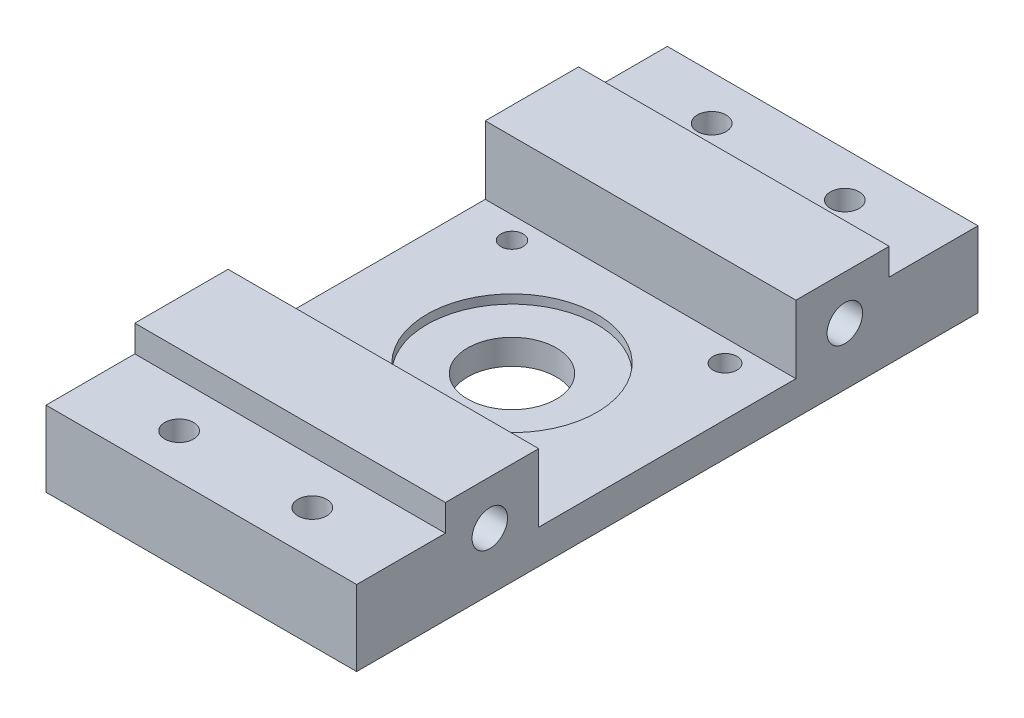
ISO-10303-21;
HEADER;
FILE_DESCRIPTION(('STEP AP214'),'2;1');
FILE_NAME('part.step','',(''),(''),'','','');
FILE_SCHEMA(('AUTOMOTIVE_DESIGN { 1 0 10303 214 1 1 1 1 }'));
ENDSEC;
DATA;
#1=APPLICATION_CONTEXT('core data for automotive mechanical design processes');
#2=APPLICATION_PROTOCOL_DEFINITION('international standard','automotive_design',2000,#1);
#3=PRODUCT_CONTEXT('',#1,'mechanical');
#4=PRODUCT('Part','Part','',(#3));
#5=PRODUCT_RELATED_PRODUCT_CATEGORY('part','',(#4));
#6=PRODUCT_DEFINITION_FORMATION('','',#4);
#7=PRODUCT_DEFINITION_CONTEXT('part definition',#1,'design');
#8=PRODUCT_DEFINITION('design','',#6,#7);
#9=PRODUCT_DEFINITION_SHAPE('','',#8);
#10=(LENGTH_UNIT() NAMED_UNIT(*) SI_UNIT(.MILLI.,.METRE.));
#11=(NAMED_UNIT(*) PLANE_ANGLE_UNIT() SI_UNIT($,.RADIAN.));
#12=(NAMED_UNIT(*) SI_UNIT($,.STERADIAN.) SOLID_ANGLE_UNIT());
#13=UNCERTAINTY_MEASURE_WITH_UNIT(LENGTH_MEASURE(1.E-05),#10,'distance_accuracy_value','');
#14=(GEOMETRIC_REPRESENTATION_CONTEXT(3) GLOBAL_UNCERTAINTY_ASSIGNED_CONTEXT((#13)) GLOBAL_UNIT_ASSIGNED_CONTEXT((#10,
#11,#12)) REPRESENTATION_CONTEXT('',''));
#15=CARTESIAN_POINT('',(0.,0.,0.));
#16=DIRECTION('',(0.,0.,1.));
#17=DIRECTION('',(1.,0.,0.));
#18=AXIS2_PLACEMENT_3D('',#15,#16,#17);
#19=CARTESIAN_POINT('',(70.,20.0000021468173,-50.));
#20=DIRECTION('',(0.,-1.,0.));
#21=DIRECTION('',(0.,0.,-1.));
#22=AXIS2_PLACEMENT_3D('',#19,#20,#21);
#23=PLANE('',#22);
#24=DIRECTION('',(0.,0.,1.));
#25=VECTOR('',#24,1.);
#26=CARTESIAN_POINT('',(70.,20.0000021468173,-50.));
#27=LINE('',#26,#25);
#28=CARTESIAN_POINT('',(70.,20.0000021468173,28.9755250101508));
#29=VERTEX_POINT('',#28);
#30=CARTESIAN_POINT('',(70.,20.0000021468172,50.));
#31=VERTEX_POINT('',#30);
#32=EDGE_CURVE('E223',#29,#31,#27,.T.);
#33=ORIENTED_EDGE('',*,*,#32,.F.);
#34=DIRECTION('',(1.,0.,0.));
#35=VECTOR('',#34,1.);
#36=CARTESIAN_POINT('',(70.001,20.0000021468173,28.9755250101508));
#37=LINE('',#36,#35);
#38=CARTESIAN_POINT('',(0.,20.0000021468173,28.9755250101508));
#39=VERTEX_POINT('',#38);
#40=EDGE_CURVE('E213',#39,#29,#37,.T.);
#41=ORIENTED_EDGE('',*,*,#40,.F.);
#42=DIRECTION('',(0.,0.,1.));
#43=VECTOR('',#42,1.);
#44=CARTESIAN_POINT('',(0.,20.0000021468173,-50.));
#45=LINE('',#44,#43);
#46=CARTESIAN_POINT('',(0.,20.0000021468172,50.));
#47=VERTEX_POINT('',#46);
#48=EDGE_CURVE('E151',#39,#47,#45,.T.);
#49=ORIENTED_EDGE('',*,*,#48,.T.);
#50=DIRECTION('',(-1.,0.,0.));
#51=VECTOR('',#50,1.);
#52=CARTESIAN_POINT('',(70.,20.0000021468172,50.));
#53=LINE('',#52,#51);
#54=EDGE_CURVE('E165',#31,#47,#53,.T.);
#55=ORIENTED_EDGE('',*,*,#54,.F.);
#56=EDGE_LOOP('',(#33,#41,#49,#55));
#57=FACE_BOUND('',#56,.T.);
#58=ADVANCED_FACE('F33',(#57),#23,.F.);
#59=CARTESIAN_POINT('',(70.,-2.99999785318272,-70.0054460886443));
#60=DIRECTION('',(0.,0.,1.));
#61=DIRECTION('',(1.,0.,0.));
#62=AXIS2_PLACEMENT_3D('',#59,#60,#61);
#63=PLANE('',#62);
#64=DIRECTION('',(0.,1.,0.));
#65=VECTOR('',#64,1.);
#66=CARTESIAN_POINT('',(0.,-2.99999785318272,-70.0054460886443));
#67=LINE('',#66,#65);
#68=CARTESIAN_POINT('',(0.,-2.99999785318272,-70.0054460886443));
#69=VERTEX_POINT('',#68);
#70=CARTESIAN_POINT('',(0.,14.0000021468173,-70.0054460886443));
#71=VERTEX_POINT('',#70);
#72=EDGE_CURVE('E143',#69,#71,#67,.T.);
#73=ORIENTED_EDGE('',*,*,#72,.T.);
#74=DIRECTION('',(-1.,0.,0.));
#75=VECTOR('',#74,1.);
#76=CARTESIAN_POINT('',(70.,14.0000021468173,-70.0054460886443));
#77=LINE('',#76,#75);
#78=CARTESIAN_POINT('',(70.,14.0000021468173,-70.0054460886443));
#79=VERTEX_POINT('',#78);
#80=EDGE_CURVE('E11',#79,#71,#77,.T.);
#81=ORIENTED_EDGE('',*,*,#80,.F.);
#82=DIRECTION('',(0.,1.,0.));
#83=VECTOR('',#82,1.);
#84=CARTESIAN_POINT('',(70.,-2.99999785318272,-70.0054460886443));
#85=LINE('',#84,#83);
#86=CARTESIAN_POINT('',(70.,-2.99999785318272,-70.0054460886443));
#87=VERTEX_POINT('',#86);
#88=EDGE_CURVE('E161',#87,#79,#85,.T.);
#89=ORIENTED_EDGE('',*,*,#88,.F.);
#90=DIRECTION('',(-1.,0.,0.));
#91=VECTOR('',#90,1.);
#92=CARTESIAN_POINT('',(70.,-2.99999785318272,-70.0054460886443));
#93=LINE('',#92,#91);
#94=EDGE_CURVE('E139',#87,#69,#93,.T.);
#95=ORIENTED_EDGE('',*,*,#94,.T.);
#96=EDGE_LOOP('',(#73,#81,#89,#95));
#97=FACE_BOUND('',#96,.T.);
#98=ADVANCED_FACE('F35',(#97),#63,.F.);
#99=CARTESIAN_POINT('',(70.,14.0000021468173,-70.0054460886443));
#100=DIRECTION('',(0.,-1.,0.));
#101=DIRECTION('',(0.,0.,-1.));
#102=AXIS2_PLACEMENT_3D('',#99,#100,#101);
#103=PLANE('',#102);
#104=CARTESIAN_POINT('',(20.,14.0000021468173,-60.0027230443222));
#105=DIRECTION('',(0.,1.,0.));
#106=DIRECTION('',(0.,0.,1.));
#107=AXIS2_PLACEMENT_3D('',#104,#105,#106);
#108=CIRCLE('',#107,3.25);
#109=CARTESIAN_POINT('',(20.,14.0000021468173,-56.7527230443222));
#110=VERTEX_POINT('',#109);
#111=EDGE_CURVE('E254',#110,#110,#108,.T.);
#112=ORIENTED_EDGE('',*,*,#111,.F.);
#113=EDGE_LOOP('',(#112));
#114=FACE_BOUND('',#113,.T.);
#115=CARTESIAN_POINT('',(50.,14.0000021468173,-60.0027230443222));
#116=DIRECTION('',(0.,1.,0.));
#117=DIRECTION('',(0.,0.,1.));
#118=AXIS2_PLACEMENT_3D('',#115,#116,#117);
#119=CIRCLE('',#118,3.25);
#120=CARTESIAN_POINT('',(50.,14.0000021468173,-56.7527230443222));
#121=VERTEX_POINT('',#120);
#122=EDGE_CURVE('E247',#121,#121,#119,.T.);
#123=ORIENTED_EDGE('',*,*,#122,.F.);
#124=EDGE_LOOP('',(#123));
#125=FACE_BOUND('',#124,.T.);
#126=DIRECTION('',(0.,0.,1.));
#127=VECTOR('',#126,1.);
#128=CARTESIAN_POINT('',(0.,14.0000021468173,-70.0054460886443));
#129=LINE('',#128,#127);
#130=CARTESIAN_POINT('',(0.,14.0000021468173,-50.));
#131=VERTEX_POINT('',#130);
#132=EDGE_CURVE('E146',#71,#131,#129,.T.);
#133=ORIENTED_EDGE('',*,*,#132,.T.);
#134=DIRECTION('',(-1.,0.,0.));
#135=VECTOR('',#134,1.);
#136=CARTESIAN_POINT('',(70.,14.0000021468173,-50.));
#137=LINE('',#136,#135);
#138=CARTESIAN_POINT('',(70.,14.0000021468173,-50.));
#139=VERTEX_POINT('',#138);
#140=EDGE_CURVE('E41',#139,#131,#137,.T.);
#141=ORIENTED_EDGE('',*,*,#140,.F.);
#142=DIRECTION('',(0.,0.,1.));
#143=VECTOR('',#142,1.);
#144=CARTESIAN_POINT('',(70.,14.0000021468173,-70.0054460886443));
#145=LINE('',#144,#143);
#146=EDGE_CURVE('E98',#79,#139,#145,.T.);
#147=ORIENTED_EDGE('',*,*,#146,.F.);
#148=ORIENTED_EDGE('',*,*,#80,.T.);
#149=EDGE_LOOP('',(#133,#141,#147,#148));
#150=FACE_BOUND('',#149,.T.);
#151=ADVANCED_FACE('F348',(#114,#125,#150),#103,.F.);
#152=CARTESIAN_POINT('',(70.,14.0000021468173,-50.));
#153=DIRECTION('',(0.,0.,1.));
#154=DIRECTION('',(1.,0.,0.));
#155=AXIS2_PLACEMENT_3D('',#152,#153,#154);
#156=PLANE('',#155);
#157=DIRECTION('',(0.,1.,0.));
#158=VECTOR('',#157,1.);
#159=CARTESIAN_POINT('',(0.,14.0000021468173,-50.));
#160=LINE('',#159,#158);
#161=CARTESIAN_POINT('',(0.,20.0000021468173,-50.));
#162=VERTEX_POINT('',#161);
#163=EDGE_CURVE('E149',#131,#162,#160,.T.);
#164=ORIENTED_EDGE('',*,*,#163,.T.);
#165=DIRECTION('',(-1.,0.,0.));
#166=VECTOR('',#165,1.);
#167=CARTESIAN_POINT('',(70.,20.0000021468173,-50.));
#168=LINE('',#167,#166);
#169=CARTESIAN_POINT('',(70.,20.0000021468173,-50.));
#170=VERTEX_POINT('',#169);
#171=EDGE_CURVE('E168',#170,#162,#168,.T.);
#172=ORIENTED_EDGE('',*,*,#171,.F.);
#173=DIRECTION('',(0.,1.,0.));
#174=VECTOR('',#173,1.);
#175=CARTESIAN_POINT('',(70.,14.0000021468173,-50.));
#176=LINE('',#175,#174);
#177=EDGE_CURVE('E176',#139,#170,#176,.T.);
#178=ORIENTED_EDGE('',*,*,#177,.F.);
#179=ORIENTED_EDGE('',*,*,#140,.T.);
#180=EDGE_LOOP('',(#164,#172,#178,#179));
#181=FACE_BOUND('',#180,.T.);
#182=ADVANCED_FACE('F174',(#181),#156,.F.);
#183=CARTESIAN_POINT('',(0.,20.0000021468173,-28.9755250101508));
#184=VERTEX_POINT('',#183);
#185=EDGE_CURVE('E152',#162,#184,#45,.T.);
#186=ORIENTED_EDGE('',*,*,#185,.T.);
#187=DIRECTION('',(-1.,0.,0.));
#188=VECTOR('',#187,1.);
#189=CARTESIAN_POINT('',(70.001,20.0000021468173,-28.9755250101508));
#190=LINE('',#189,#188);
#191=CARTESIAN_POINT('',(70.,20.0000021468173,-28.9755250101508));
#192=VERTEX_POINT('',#191);
#193=EDGE_CURVE('E190',#192,#184,#190,.T.);
#194=ORIENTED_EDGE('',*,*,#193,.F.);
#195=EDGE_CURVE('E227',#170,#192,#27,.T.);
#196=ORIENTED_EDGE('',*,*,#195,.F.);
#197=ORIENTED_EDGE('',*,*,#171,.T.);
#198=EDGE_LOOP('',(#186,#194,#196,#197));
#199=FACE_BOUND('',#198,.T.);
#200=ADVANCED_FACE('F187',(#199),#23,.F.);
#201=CARTESIAN_POINT('',(70.,14.0000021468173,50.));
#202=DIRECTION('',(0.,0.,-1.));
#203=DIRECTION('',(-1.,0.,0.));
#204=AXIS2_PLACEMENT_3D('',#201,#202,#203);
#205=PLANE('',#204);
#206=DIRECTION('',(0.,-1.,0.));
#207=VECTOR('',#206,1.);
#208=CARTESIAN_POINT('',(0.,14.0000021468173,50.));
#209=LINE('',#208,#207);
#210=CARTESIAN_POINT('',(0.,14.0000021468173,50.));
#211=VERTEX_POINT('',#210);
#212=EDGE_CURVE('E155',#47,#211,#209,.T.);
#213=ORIENTED_EDGE('',*,*,#212,.T.);
#214=DIRECTION('',(-1.,0.,0.));
#215=VECTOR('',#214,1.);
#216=CARTESIAN_POINT('',(70.,14.0000021468173,50.));
#217=LINE('',#216,#215);
#218=CARTESIAN_POINT('',(70.,14.0000021468173,50.));
#219=VERTEX_POINT('',#218);
#220=EDGE_CURVE('E134',#219,#211,#217,.T.);
#221=ORIENTED_EDGE('',*,*,#220,.F.);
#222=DIRECTION('',(0.,-1.,0.));
#223=VECTOR('',#222,1.);
#224=CARTESIAN_POINT('',(70.,14.0000021468173,50.));
#225=LINE('',#224,#223);
#226=EDGE_CURVE('E122',#31,#219,#225,.T.);
#227=ORIENTED_EDGE('',*,*,#226,.F.);
#228=ORIENTED_EDGE('',*,*,#54,.T.);
#229=EDGE_LOOP('',(#213,#221,#227,#228));
#230=FACE_BOUND('',#229,.T.);
#231=ADVANCED_FACE('F331',(#230),#205,.F.);
#232=CARTESIAN_POINT('',(70.,14.0000021468173,70.));
#233=DIRECTION('',(0.,-1.,0.));
#234=DIRECTION('',(0.,0.,-1.));
#235=AXIS2_PLACEMENT_3D('',#232,#233,#234);
#236=PLANE('',#235);
#237=CARTESIAN_POINT('',(50.,14.0000021468173,60.));
#238=DIRECTION('',(0.,1.,0.));
#239=DIRECTION('',(0.,0.,1.));
#240=AXIS2_PLACEMENT_3D('',#237,#238,#239);
#241=CIRCLE('',#240,3.25);
#242=CARTESIAN_POINT('',(50.,14.0000021468173,63.25));
#243=VERTEX_POINT('',#242);
#244=EDGE_CURVE('E255',#243,#243,#241,.T.);
#245=ORIENTED_EDGE('',*,*,#244,.F.);
#246=EDGE_LOOP('',(#245));
#247=FACE_BOUND('',#246,.T.);
#248=CARTESIAN_POINT('',(20.,14.0000021468173,60.));
#249=DIRECTION('',(0.,1.,0.));
#250=DIRECTION('',(0.,0.,1.));
#251=AXIS2_PLACEMENT_3D('',#248,#249,#250);
#252=CIRCLE('',#251,3.25);
#253=CARTESIAN_POINT('',(20.,14.0000021468173,63.25));
#254=VERTEX_POINT('',#253);
#255=EDGE_CURVE('E265',#254,#254,#252,.T.);
#256=ORIENTED_EDGE('',*,*,#255,.F.);
#257=EDGE_LOOP('',(#256));
#258=FACE_BOUND('',#257,.T.);
#259=DIRECTION('',(0.,0.,1.));
#260=VECTOR('',#259,1.);
#261=CARTESIAN_POINT('',(0.,14.0000021468173,70.));
#262=LINE('',#261,#260);
#263=CARTESIAN_POINT('',(0.,14.0000021468173,70.));
#264=VERTEX_POINT('',#263);
#265=EDGE_CURVE('E131',#211,#264,#262,.T.);
#266=ORIENTED_EDGE('',*,*,#265,.T.);
#267=DIRECTION('',(-1.,0.,0.));
#268=VECTOR('',#267,1.);
#269=CARTESIAN_POINT('',(70.,14.0000021468173,70.));
#270=LINE('',#269,#268);
#271=CARTESIAN_POINT('',(70.,14.0000021468173,70.));
#272=VERTEX_POINT('',#271);
#273=EDGE_CURVE('E128',#272,#264,#270,.T.);
#274=ORIENTED_EDGE('',*,*,#273,.F.);
#275=DIRECTION('',(0.,0.,1.));
#276=VECTOR('',#275,1.);
#277=CARTESIAN_POINT('',(70.,14.0000021468173,70.));
#278=LINE('',#277,#276);
#279=EDGE_CURVE('E113',#219,#272,#278,.T.);
#280=ORIENTED_EDGE('',*,*,#279,.F.);
#281=ORIENTED_EDGE('',*,*,#220,.T.);
#282=EDGE_LOOP('',(#266,#274,#280,#281));
#283=FACE_BOUND('',#282,.T.);
#284=ADVANCED_FACE('F129',(#247,#258,#283),#236,.F.);
#285=CARTESIAN_POINT('',(70.,-2.99999785318274,70.));
#286=DIRECTION('',(0.,0.,-1.));
#287=DIRECTION('',(-1.,0.,0.));
#288=AXIS2_PLACEMENT_3D('',#285,#286,#287);
#289=PLANE('',#288);
#290=DIRECTION('',(0.,-1.,0.));
#291=VECTOR('',#290,1.);
#292=CARTESIAN_POINT('',(0.,-2.99999785318274,70.));
#293=LINE('',#292,#291);
#294=CARTESIAN_POINT('',(0.,-2.99999785318274,70.));
#295=VERTEX_POINT('',#294);
#296=EDGE_CURVE('E158',#264,#295,#293,.T.);
#297=ORIENTED_EDGE('',*,*,#296,.T.);
#298=DIRECTION('',(-1.,0.,0.));
#299=VECTOR('',#298,1.);
#300=CARTESIAN_POINT('',(70.,-2.99999785318274,70.));
#301=LINE('',#300,#299);
#302=CARTESIAN_POINT('',(70.,-2.99999785318274,70.));
#303=VERTEX_POINT('',#302);
#304=EDGE_CURVE('E135',#303,#295,#301,.T.);
#305=ORIENTED_EDGE('',*,*,#304,.F.);
#306=DIRECTION('',(0.,-1.,0.));
#307=VECTOR('',#306,1.);
#308=CARTESIAN_POINT('',(70.,-2.99999785318274,70.));
#309=LINE('',#308,#307);
#310=EDGE_CURVE('E119',#272,#303,#309,.T.);
#311=ORIENTED_EDGE('',*,*,#310,.F.);
#312=ORIENTED_EDGE('',*,*,#273,.T.);
#313=EDGE_LOOP('',(#297,#305,#311,#312));
#314=FACE_BOUND('',#313,.T.);
#315=ADVANCED_FACE('F137',(#314),#289,.F.);
#316=CARTESIAN_POINT('',(70.,-2.99999785318272,-70.0054460886443));
#317=DIRECTION('',(0.,1.,0.));
#318=DIRECTION('',(0.,0.,1.));
#319=AXIS2_PLACEMENT_3D('',#316,#317,#318);
#320=PLANE('',#319);
#321=CARTESIAN_POINT('',(11.0000000000066,-2.99999785318273,23.9999999999999));
#322=DIRECTION('',(0.,1.,0.));
#323=DIRECTION('',(0.,0.,1.));
#324=AXIS2_PLACEMENT_3D('',#321,#322,#323);
#325=CIRCLE('',#324,2.70000000000038);
#326=CARTESIAN_POINT('',(11.0000000000066,-2.99999785318273,26.7000000000003));
#327=VERTEX_POINT('',#326);
#328=EDGE_CURVE('E298',#327,#327,#325,.F.);
#329=ORIENTED_EDGE('',*,*,#328,.F.);
#330=EDGE_LOOP('',(#329));
#331=FACE_BOUND('',#330,.T.);
#332=CARTESIAN_POINT('',(59.0000000000067,-2.99999785318273,23.9999999999999));
#333=DIRECTION('',(0.,1.,0.));
#334=DIRECTION('',(0.,0.,1.));
#335=AXIS2_PLACEMENT_3D('',#332,#333,#334);
#336=CIRCLE('',#335,2.61849762857902);
#337=CARTESIAN_POINT('',(59.0000000000067,-2.99999785318273,26.6184976285789));
#338=VERTEX_POINT('',#337);
#339=EDGE_CURVE('E305',#338,#338,#336,.F.);
#340=ORIENTED_EDGE('',*,*,#339,.F.);
#341=EDGE_LOOP('',(#340));
#342=FACE_BOUND('',#341,.T.);
#343=CARTESIAN_POINT('',(59.0000000000066,-2.99999785318273,-24.0000000000002));
#344=DIRECTION('',(0.,1.,0.));
#345=DIRECTION('',(0.,0.,1.));
#346=AXIS2_PLACEMENT_3D('',#343,#344,#345);
#347=CIRCLE('',#346,2.69999999999999);
#348=CARTESIAN_POINT('',(59.0000000000066,-2.99999785318273,-21.3000000000002));
#349=VERTEX_POINT('',#348);
#350=EDGE_CURVE('E297',#349,#349,#347,.F.);
#351=ORIENTED_EDGE('',*,*,#350,.F.);
#352=EDGE_LOOP('',(#351));
#353=FACE_BOUND('',#352,.T.);
#354=CARTESIAN_POINT('',(11.0000000000066,-2.99999785318273,-23.9999999999999));
#355=DIRECTION('',(0.,1.,0.));
#356=DIRECTION('',(0.,0.,1.));
#357=AXIS2_PLACEMENT_3D('',#354,#355,#356);
#358=CIRCLE('',#357,2.5);
#359=CARTESIAN_POINT('',(11.0000000000066,-2.99999785318273,-21.4999999999999));
#360=VERTEX_POINT('',#359);
#361=EDGE_CURVE('E291',#360,#360,#358,.F.);
#362=ORIENTED_EDGE('',*,*,#361,.F.);
#363=EDGE_LOOP('',(#362));
#364=FACE_BOUND('',#363,.T.);
#365=CARTESIAN_POINT('',(35.,-2.99999785318273,0.));
#366=DIRECTION('',(0.,1.,0.));
#367=DIRECTION('',(0.,0.,1.));
#368=AXIS2_PLACEMENT_3D('',#365,#366,#367);
#369=CIRCLE('',#368,10.);
#370=CARTESIAN_POINT('',(35.,-2.99999785318273,9.99999999999999));
#371=VERTEX_POINT('',#370);
#372=EDGE_CURVE('E283',#371,#371,#369,.F.);
#373=ORIENTED_EDGE('',*,*,#372,.F.);
#374=EDGE_LOOP('',(#373));
#375=FACE_BOUND('',#374,.T.);
#376=CARTESIAN_POINT('',(20.,-2.99999785318272,-60.0027230443222));
#377=DIRECTION('',(0.,1.,0.));
#378=DIRECTION('',(0.,0.,1.));
#379=AXIS2_PLACEMENT_3D('',#376,#377,#378);
#380=CIRCLE('',#379,3.25);
#381=CARTESIAN_POINT('',(20.,-2.99999785318272,-56.7527230443222));
#382=VERTEX_POINT('',#381);
#383=EDGE_CURVE('E250',#382,#382,#380,.F.);
#384=ORIENTED_EDGE('',*,*,#383,.F.);
#385=EDGE_LOOP('',(#384));
#386=FACE_BOUND('',#385,.T.);
#387=CARTESIAN_POINT('',(50.,-2.99999785318274,60.));
#388=DIRECTION('',(0.,1.,0.));
#389=DIRECTION('',(0.,0.,1.));
#390=AXIS2_PLACEMENT_3D('',#387,#388,#389);
#391=CIRCLE('',#390,3.25);
#392=CARTESIAN_POINT('',(50.,-2.99999785318274,63.25));
#393=VERTEX_POINT('',#392);
#394=EDGE_CURVE('E251',#393,#393,#391,.F.);
#395=ORIENTED_EDGE('',*,*,#394,.F.);
#396=EDGE_LOOP('',(#395));
#397=FACE_BOUND('',#396,.T.);
#398=CARTESIAN_POINT('',(20.,-2.99999785318274,60.));
#399=DIRECTION('',(0.,1.,0.));
#400=DIRECTION('',(0.,0.,1.));
#401=AXIS2_PLACEMENT_3D('',#398,#399,#400);
#402=CIRCLE('',#401,3.25);
#403=CARTESIAN_POINT('',(20.,-2.99999785318274,63.25));
#404=VERTEX_POINT('',#403);
#405=EDGE_CURVE('E258',#404,#404,#402,.F.);
#406=ORIENTED_EDGE('',*,*,#405,.F.);
#407=EDGE_LOOP('',(#406));
#408=FACE_BOUND('',#407,.T.);
#409=CARTESIAN_POINT('',(50.,-2.99999785318272,-60.0027230443222));
#410=DIRECTION('',(0.,1.,0.));
#411=DIRECTION('',(0.,0.,1.));
#412=AXIS2_PLACEMENT_3D('',#409,#410,#411);
#413=CIRCLE('',#412,3.25);
#414=CARTESIAN_POINT('',(50.,-2.99999785318272,-56.7527230443222));
#415=VERTEX_POINT('',#414);
#416=EDGE_CURVE('E237',#415,#415,#413,.F.);
#417=ORIENTED_EDGE('',*,*,#416,.F.);
#418=EDGE_LOOP('',(#417));
#419=FACE_BOUND('',#418,.T.);
#420=DIRECTION('',(0.,0.,-1.));
#421=VECTOR('',#420,1.);
#422=CARTESIAN_POINT('',(0.,-2.99999785318272,-70.0054460886443));
#423=LINE('',#422,#421);
#424=EDGE_CURVE('E90',#295,#69,#423,.T.);
#425=ORIENTED_EDGE('',*,*,#424,.T.);
#426=ORIENTED_EDGE('',*,*,#94,.F.);
#427=DIRECTION('',(0.,0.,-1.));
#428=VECTOR('',#427,1.);
#429=CARTESIAN_POINT('',(70.,-2.99999785318272,-70.0054460886443));
#430=LINE('',#429,#428);
#431=EDGE_CURVE('E57',#303,#87,#430,.T.);
#432=ORIENTED_EDGE('',*,*,#431,.F.);
#433=ORIENTED_EDGE('',*,*,#304,.T.);
#434=EDGE_LOOP('',(#425,#426,#432,#433));
#435=FACE_BOUND('',#434,.T.);
#436=ADVANCED_FACE('F332',(#331,#342,#353,#364,#375,#386,#397,#408,#419,#435),#320,.F.);
#437=CARTESIAN_POINT('',(70.,0.,0.));
#438=DIRECTION('',(1.,0.,0.));
#439=DIRECTION('',(0.,0.,-1.));
#440=AXIS2_PLACEMENT_3D('',#437,#438,#439);
#441=PLANE('',#440);
#442=DIRECTION('',(0.,1.,0.));
#443=VECTOR('',#442,1.);
#444=CARTESIAN_POINT('',(70.,21.3503659025024,28.9755250101508));
#445=LINE('',#444,#443);
#446=CARTESIAN_POINT('',(70.,4.67222836448205,28.9755250101508));
#447=VERTEX_POINT('',#446);
#448=EDGE_CURVE('E215',#447,#29,#445,.T.);
#449=ORIENTED_EDGE('',*,*,#448,.T.);
#450=ORIENTED_EDGE('',*,*,#32,.T.);
#451=ORIENTED_EDGE('',*,*,#226,.T.);
#452=ORIENTED_EDGE('',*,*,#279,.T.);
#453=ORIENTED_EDGE('',*,*,#310,.T.);
#454=ORIENTED_EDGE('',*,*,#431,.T.);
#455=ORIENTED_EDGE('',*,*,#88,.T.);
#456=ORIENTED_EDGE('',*,*,#146,.T.);
#457=ORIENTED_EDGE('',*,*,#177,.T.);
#458=ORIENTED_EDGE('',*,*,#195,.T.);
#459=DIRECTION('',(0.,-1.,0.));
#460=VECTOR('',#459,1.);
#461=CARTESIAN_POINT('',(70.,21.3503659025024,-28.9755250101508));
#462=LINE('',#461,#460);
#463=CARTESIAN_POINT('',(70.,4.67222836448205,-28.9755250101508));
#464=VERTEX_POINT('',#463);
#465=EDGE_CURVE('E268',#192,#464,#462,.T.);
#466=ORIENTED_EDGE('',*,*,#465,.T.);
#467=DIRECTION('',(0.,0.,1.));
#468=VECTOR('',#467,1.);
#469=CARTESIAN_POINT('',(70.,4.67222836448205,-28.9755250101508));
#470=LINE('',#469,#468);
#471=EDGE_CURVE('E221',#464,#447,#470,.T.);
#472=ORIENTED_EDGE('',*,*,#471,.T.);
#473=EDGE_LOOP('',(#449,#450,#451,#452,#453,#454,#455,#456,#457,#458,#466,#472));
#474=FACE_BOUND('',#473,.T.);
#475=CARTESIAN_POINT('',(70.,10.0000010734087,-40.));
#476=DIRECTION('',(1.,0.,0.));
#477=DIRECTION('',(0.,0.,-1.));
#478=AXIS2_PLACEMENT_3D('',#475,#476,#477);
#479=CIRCLE('',#478,4.);
#480=CARTESIAN_POINT('',(70.,10.0000010734087,-44.));
#481=VERTEX_POINT('',#480);
#482=EDGE_CURVE('E240',#481,#481,#479,.F.);
#483=ORIENTED_EDGE('',*,*,#482,.T.);
#484=EDGE_LOOP('',(#483));
#485=FACE_BOUND('',#484,.T.);
#486=CARTESIAN_POINT('',(70.,10.0000010734087,40.));
#487=DIRECTION('',(1.,0.,0.));
#488=DIRECTION('',(0.,0.,-1.));
#489=AXIS2_PLACEMENT_3D('',#486,#487,#488);
#490=CIRCLE('',#489,4.);
#491=CARTESIAN_POINT('',(70.,10.0000010734087,36.));
#492=VERTEX_POINT('',#491);
#493=EDGE_CURVE('E233',#492,#492,#490,.F.);
#494=ORIENTED_EDGE('',*,*,#493,.T.);
#495=EDGE_LOOP('',(#494));
#496=FACE_BOUND('',#495,.T.);
#497=ADVANCED_FACE('F116',(#474,#485,#496),#441,.T.);
#498=CARTESIAN_POINT('',(0.,0.,0.));
#499=DIRECTION('',(1.,0.,0.));
#500=DIRECTION('',(0.,0.,-1.));
#501=AXIS2_PLACEMENT_3D('',#498,#499,#500);
#502=PLANE('',#501);
#503=ORIENTED_EDGE('',*,*,#48,.F.);
#504=DIRECTION('',(0.,1.,0.));
#505=VECTOR('',#504,1.);
#506=CARTESIAN_POINT('',(0.,21.3503659025024,28.9755250101508));
#507=LINE('',#506,#505);
#508=CARTESIAN_POINT('',(0.,4.67222836448205,28.9755250101508));
#509=VERTEX_POINT('',#508);
#510=EDGE_CURVE('E218',#509,#39,#507,.T.);
#511=ORIENTED_EDGE('',*,*,#510,.F.);
#512=DIRECTION('',(0.,0.,1.));
#513=VECTOR('',#512,1.);
#514=CARTESIAN_POINT('',(0.,4.67222836448205,-28.9755250101508));
#515=LINE('',#514,#513);
#516=CARTESIAN_POINT('',(0.,4.67222836448205,-28.9755250101508));
#517=VERTEX_POINT('',#516);
#518=EDGE_CURVE('E272',#517,#509,#515,.T.);
#519=ORIENTED_EDGE('',*,*,#518,.F.);
#520=DIRECTION('',(0.,-1.,0.));
#521=VECTOR('',#520,1.);
#522=CARTESIAN_POINT('',(0.,21.3503659025024,-28.9755250101508));
#523=LINE('',#522,#521);
#524=EDGE_CURVE('E48',#184,#517,#523,.T.);
#525=ORIENTED_EDGE('',*,*,#524,.F.);
#526=ORIENTED_EDGE('',*,*,#185,.F.);
#527=ORIENTED_EDGE('',*,*,#163,.F.);
#528=ORIENTED_EDGE('',*,*,#132,.F.);
#529=ORIENTED_EDGE('',*,*,#72,.F.);
#530=ORIENTED_EDGE('',*,*,#424,.F.);
#531=ORIENTED_EDGE('',*,*,#296,.F.);
#532=ORIENTED_EDGE('',*,*,#265,.F.);
#533=ORIENTED_EDGE('',*,*,#212,.F.);
#534=EDGE_LOOP('',(#503,#511,#519,#525,#526,#527,#528,#529,#530,#531,#532,#533));
#535=FACE_BOUND('',#534,.T.);
#536=CARTESIAN_POINT('',(0.,10.0000010734087,-40.));
#537=DIRECTION('',(-1.,0.,0.));
#538=DIRECTION('',(0.,0.,1.));
#539=AXIS2_PLACEMENT_3D('',#536,#537,#538);
#540=CIRCLE('',#539,4.);
#541=CARTESIAN_POINT('',(0.,10.0000010734087,-36.));
#542=VERTEX_POINT('',#541);
#543=EDGE_CURVE('E147',#542,#542,#540,.T.);
#544=ORIENTED_EDGE('',*,*,#543,.F.);
#545=EDGE_LOOP('',(#544));
#546=FACE_BOUND('',#545,.T.);
#547=CARTESIAN_POINT('',(0.,10.0000010734087,40.));
#548=DIRECTION('',(-1.,0.,0.));
#549=DIRECTION('',(0.,0.,1.));
#550=AXIS2_PLACEMENT_3D('',#547,#548,#549);
#551=CIRCLE('',#550,4.);
#552=CARTESIAN_POINT('',(0.,10.0000010734087,44.));
#553=VERTEX_POINT('',#552);
#554=EDGE_CURVE('E236',#553,#553,#551,.T.);
#555=ORIENTED_EDGE('',*,*,#554,.F.);
#556=EDGE_LOOP('',(#555));
#557=FACE_BOUND('',#556,.T.);
#558=ADVANCED_FACE('F180',(#535,#546,#557),#502,.F.);
#559=CARTESIAN_POINT('',(70.001,10.0000010734087,40.));
#560=DIRECTION('',(-1.,0.,0.));
#561=DIRECTION('',(0.,0.,1.));
#562=AXIS2_PLACEMENT_3D('',#559,#560,#561);
#563=CYLINDRICAL_SURFACE('',#562,4.);
#564=ORIENTED_EDGE('',*,*,#493,.F.);
#565=EDGE_LOOP('',(#564));
#566=FACE_BOUND('',#565,.T.);
#567=ORIENTED_EDGE('',*,*,#554,.T.);
#568=EDGE_LOOP('',(#567));
#569=FACE_BOUND('',#568,.T.);
#570=ADVANCED_FACE('F412',(#566,#569),#563,.F.);
#571=CARTESIAN_POINT('',(70.001,10.0000010734087,-40.));
#572=DIRECTION('',(-1.,0.,0.));
#573=DIRECTION('',(0.,0.,1.));
#574=AXIS2_PLACEMENT_3D('',#571,#572,#573);
#575=CYLINDRICAL_SURFACE('',#574,4.);
#576=ORIENTED_EDGE('',*,*,#482,.F.);
#577=EDGE_LOOP('',(#576));
#578=FACE_BOUND('',#577,.T.);
#579=ORIENTED_EDGE('',*,*,#543,.T.);
#580=EDGE_LOOP('',(#579));
#581=FACE_BOUND('',#580,.T.);
#582=ADVANCED_FACE('F370',(#578,#581),#575,.F.);
#583=CARTESIAN_POINT('',(50.,-3.00099785318274,-60.0027230443222));
#584=DIRECTION('',(0.,1.,0.));
#585=DIRECTION('',(0.,0.,1.));
#586=AXIS2_PLACEMENT_3D('',#583,#584,#585);
#587=CYLINDRICAL_SURFACE('',#586,3.25);
#588=ORIENTED_EDGE('',*,*,#122,.T.);
#589=EDGE_LOOP('',(#588));
#590=FACE_BOUND('',#589,.T.);
#591=ORIENTED_EDGE('',*,*,#416,.T.);
#592=EDGE_LOOP('',(#591));
#593=FACE_BOUND('',#592,.T.);
#594=ADVANCED_FACE('F366',(#590,#593),#587,.F.);
#595=CARTESIAN_POINT('',(20.,-3.00099785318275,60.));
#596=DIRECTION('',(0.,1.,0.));
#597=DIRECTION('',(0.,0.,1.));
#598=AXIS2_PLACEMENT_3D('',#595,#596,#597);
#599=CYLINDRICAL_SURFACE('',#598,3.25);
#600=ORIENTED_EDGE('',*,*,#255,.T.);
#601=EDGE_LOOP('',(#600));
#602=FACE_BOUND('',#601,.T.);
#603=ORIENTED_EDGE('',*,*,#405,.T.);
#604=EDGE_LOOP('',(#603));
#605=FACE_BOUND('',#604,.T.);
#606=ADVANCED_FACE('F369',(#602,#605),#599,.F.);
#607=CARTESIAN_POINT('',(50.,-3.00099785318275,60.));
#608=DIRECTION('',(0.,1.,0.));
#609=DIRECTION('',(0.,0.,1.));
#610=AXIS2_PLACEMENT_3D('',#607,#608,#609);
#611=CYLINDRICAL_SURFACE('',#610,3.25);
#612=ORIENTED_EDGE('',*,*,#244,.T.);
#613=EDGE_LOOP('',(#612));
#614=FACE_BOUND('',#613,.T.);
#615=ORIENTED_EDGE('',*,*,#394,.T.);
#616=EDGE_LOOP('',(#615));
#617=FACE_BOUND('',#616,.T.);
#618=ADVANCED_FACE('F397',(#614,#617),#611,.F.);
#619=CARTESIAN_POINT('',(20.,-3.00099785318274,-60.0027230443222));
#620=DIRECTION('',(0.,1.,0.));
#621=DIRECTION('',(0.,0.,1.));
#622=AXIS2_PLACEMENT_3D('',#619,#620,#621);
#623=CYLINDRICAL_SURFACE('',#622,3.25);
#624=ORIENTED_EDGE('',*,*,#111,.T.);
#625=EDGE_LOOP('',(#624));
#626=FACE_BOUND('',#625,.T.);
#627=ORIENTED_EDGE('',*,*,#383,.T.);
#628=EDGE_LOOP('',(#627));
#629=FACE_BOUND('',#628,.T.);
#630=ADVANCED_FACE('F341',(#626,#629),#623,.F.);
#631=CARTESIAN_POINT('',(70.001,21.3503659025024,28.9755250101508));
#632=DIRECTION('',(0.,0.,1.));
#633=DIRECTION('',(1.,0.,0.));
#634=AXIS2_PLACEMENT_3D('',#631,#632,#633);
#635=PLANE('',#634);
#636=ORIENTED_EDGE('',*,*,#40,.T.);
#637=ORIENTED_EDGE('',*,*,#448,.F.);
#638=DIRECTION('',(-1.,0.,0.));
#639=VECTOR('',#638,1.);
#640=CARTESIAN_POINT('',(70.001,4.67222836448205,28.9755250101508));
#641=LINE('',#640,#639);
#642=EDGE_CURVE('E207',#447,#509,#641,.T.);
#643=ORIENTED_EDGE('',*,*,#642,.T.);
#644=ORIENTED_EDGE('',*,*,#510,.T.);
#645=EDGE_LOOP('',(#636,#637,#643,#644));
#646=FACE_BOUND('',#645,.T.);
#647=ADVANCED_FACE('F214',(#646),#635,.F.);
#648=CARTESIAN_POINT('',(70.001,21.3503659025024,-28.9755250101508));
#649=DIRECTION('',(0.,0.,-1.));
#650=DIRECTION('',(-1.,0.,0.));
#651=AXIS2_PLACEMENT_3D('',#648,#649,#650);
#652=PLANE('',#651);
#653=ORIENTED_EDGE('',*,*,#193,.T.);
#654=ORIENTED_EDGE('',*,*,#524,.T.);
#655=DIRECTION('',(-1.,0.,0.));
#656=VECTOR('',#655,1.);
#657=CARTESIAN_POINT('',(70.001,4.67222836448205,-28.9755250101508));
#658=LINE('',#657,#656);
#659=EDGE_CURVE('E270',#464,#517,#658,.T.);
#660=ORIENTED_EDGE('',*,*,#659,.F.);
#661=ORIENTED_EDGE('',*,*,#465,.F.);
#662=EDGE_LOOP('',(#653,#654,#660,#661));
#663=FACE_BOUND('',#662,.T.);
#664=ADVANCED_FACE('F323',(#663),#652,.F.);
#665=CARTESIAN_POINT('',(70.001,4.67222836448205,-28.9755250101508));
#666=DIRECTION('',(0.,-1.,0.));
#667=DIRECTION('',(0.,0.,-1.));
#668=AXIS2_PLACEMENT_3D('',#665,#666,#667);
#669=PLANE('',#668);
#670=CARTESIAN_POINT('',(11.0000000000066,4.67222836448205,23.9999999999999));
#671=DIRECTION('',(0.,1.,0.));
#672=DIRECTION('',(0.,0.,1.));
#673=AXIS2_PLACEMENT_3D('',#670,#671,#672);
#674=CIRCLE('',#673,2.70000000000038);
#675=CARTESIAN_POINT('',(11.0000000000066,4.67222836448205,26.7000000000003));
#676=VERTEX_POINT('',#675);
#677=EDGE_CURVE('E302',#676,#676,#674,.T.);
#678=ORIENTED_EDGE('',*,*,#677,.F.);
#679=EDGE_LOOP('',(#678));
#680=FACE_BOUND('',#679,.T.);
#681=CARTESIAN_POINT('',(59.0000000000067,4.67222836448205,23.9999999999999));
#682=DIRECTION('',(0.,1.,0.));
#683=DIRECTION('',(0.,0.,1.));
#684=AXIS2_PLACEMENT_3D('',#681,#682,#683);
#685=CIRCLE('',#684,2.61849762857902);
#686=CARTESIAN_POINT('',(59.0000000000067,4.67222836448205,26.6184976285789));
#687=VERTEX_POINT('',#686);
#688=EDGE_CURVE('E301',#687,#687,#685,.T.);
#689=ORIENTED_EDGE('',*,*,#688,.F.);
#690=EDGE_LOOP('',(#689));
#691=FACE_BOUND('',#690,.T.);
#692=CARTESIAN_POINT('',(59.0000000000066,4.67222836448205,-24.0000000000002));
#693=DIRECTION('',(0.,1.,0.));
#694=DIRECTION('',(0.,0.,1.));
#695=AXIS2_PLACEMENT_3D('',#692,#693,#694);
#696=CIRCLE('',#695,2.69999999999999);
#697=CARTESIAN_POINT('',(59.0000000000066,4.67222836448205,-21.3000000000002));
#698=VERTEX_POINT('',#697);
#699=EDGE_CURVE('E308',#698,#698,#696,.T.);
#700=ORIENTED_EDGE('',*,*,#699,.F.);
#701=EDGE_LOOP('',(#700));
#702=FACE_BOUND('',#701,.T.);
#703=CARTESIAN_POINT('',(11.0000000000066,4.67222836448205,-23.9999999999999));
#704=DIRECTION('',(0.,1.,0.));
#705=DIRECTION('',(0.,0.,1.));
#706=AXIS2_PLACEMENT_3D('',#703,#704,#705);
#707=CIRCLE('',#706,2.5);
#708=CARTESIAN_POINT('',(11.0000000000066,4.67222836448205,-21.4999999999999));
#709=VERTEX_POINT('',#708);
#710=EDGE_CURVE('E294',#709,#709,#707,.T.);
#711=ORIENTED_EDGE('',*,*,#710,.F.);
#712=EDGE_LOOP('',(#711));
#713=FACE_BOUND('',#712,.T.);
#714=CARTESIAN_POINT('',(35.,4.67222836448205,0.));
#715=DIRECTION('',(0.,1.,0.));
#716=DIRECTION('',(0.,0.,1.));
#717=AXIS2_PLACEMENT_3D('',#714,#715,#716);
#718=CIRCLE('',#717,19.15);
#719=CARTESIAN_POINT('',(35.,4.67222836448205,19.15));
#720=VERTEX_POINT('',#719);
#721=EDGE_CURVE('E280',#720,#720,#718,.T.);
#722=ORIENTED_EDGE('',*,*,#721,.F.);
#723=EDGE_LOOP('',(#722));
#724=FACE_BOUND('',#723,.T.);
#725=ORIENTED_EDGE('',*,*,#659,.T.);
#726=ORIENTED_EDGE('',*,*,#518,.T.);
#727=ORIENTED_EDGE('',*,*,#642,.F.);
#728=ORIENTED_EDGE('',*,*,#471,.F.);
#729=EDGE_LOOP('',(#725,#726,#727,#728));
#730=FACE_BOUND('',#729,.T.);
#731=ADVANCED_FACE('F319',(#680,#691,#702,#713,#724,#730),#669,.F.);
#732=CARTESIAN_POINT('',(35.,2.67222836448205,0.));
#733=DIRECTION('',(0.,1.,0.));
#734=DIRECTION('',(0.,0.,1.));
#735=AXIS2_PLACEMENT_3D('',#732,#733,#734);
#736=CYLINDRICAL_SURFACE('',#735,19.15);
#737=CARTESIAN_POINT('',(35.,2.67222836448205,0.));
#738=DIRECTION('',(0.,1.,0.));
#739=DIRECTION('',(0.,0.,1.));
#740=AXIS2_PLACEMENT_3D('',#737,#738,#739);
#741=CIRCLE('',#740,19.15);
#742=CARTESIAN_POINT('',(35.,2.67222836448205,19.15));
#743=VERTEX_POINT('',#742);
#744=EDGE_CURVE('E279',#743,#743,#741,.T.);
#745=ORIENTED_EDGE('',*,*,#744,.F.);
#746=EDGE_LOOP('',(#745));
#747=FACE_BOUND('',#746,.T.);
#748=ORIENTED_EDGE('',*,*,#721,.T.);
#749=EDGE_LOOP('',(#748));
#750=FACE_BOUND('',#749,.T.);
#751=ADVANCED_FACE('F322',(#747,#750),#736,.F.);
#752=CARTESIAN_POINT('',(35.,2.67222836448205,0.));
#753=DIRECTION('',(0.,1.,0.));
#754=DIRECTION('',(0.,0.,1.));
#755=AXIS2_PLACEMENT_3D('',#752,#753,#754);
#756=PLANE('',#755);
#757=CARTESIAN_POINT('',(35.,2.67222836448205,0.));
#758=DIRECTION('',(0.,1.,0.));
#759=DIRECTION('',(0.,0.,1.));
#760=AXIS2_PLACEMENT_3D('',#757,#758,#759);
#761=CIRCLE('',#760,10.);
#762=CARTESIAN_POINT('',(35.,2.67222836448205,9.99999999999999));
#763=VERTEX_POINT('',#762);
#764=EDGE_CURVE('E288',#763,#763,#761,.T.);
#765=ORIENTED_EDGE('',*,*,#764,.F.);
#766=EDGE_LOOP('',(#765));
#767=FACE_BOUND('',#766,.T.);
#768=ORIENTED_EDGE('',*,*,#744,.T.);
#769=EDGE_LOOP('',(#768));
#770=FACE_BOUND('',#769,.T.);
#771=ADVANCED_FACE('F566',(#767,#770),#756,.T.);
#772=CARTESIAN_POINT('',(35.,-3.00099785318274,0.));
#773=DIRECTION('',(0.,1.,0.));
#774=DIRECTION('',(0.,0.,1.));
#775=AXIS2_PLACEMENT_3D('',#772,#773,#774);
#776=CYLINDRICAL_SURFACE('',#775,10.);
#777=ORIENTED_EDGE('',*,*,#764,.T.);
#778=EDGE_LOOP('',(#777));
#779=FACE_BOUND('',#778,.T.);
#780=ORIENTED_EDGE('',*,*,#372,.T.);
#781=EDGE_LOOP('',(#780));
#782=FACE_BOUND('',#781,.T.);
#783=ADVANCED_FACE('F512',(#779,#782),#776,.F.);
#784=CARTESIAN_POINT('',(11.0000000000066,-3.00099785318274,-23.9999999999999));
#785=DIRECTION('',(0.,1.,0.));
#786=DIRECTION('',(0.,0.,1.));
#787=AXIS2_PLACEMENT_3D('',#784,#785,#786);
#788=CYLINDRICAL_SURFACE('',#787,2.5);
#789=ORIENTED_EDGE('',*,*,#710,.T.);
#790=EDGE_LOOP('',(#789));
#791=FACE_BOUND('',#790,.T.);
#792=ORIENTED_EDGE('',*,*,#361,.T.);
#793=EDGE_LOOP('',(#792));
#794=FACE_BOUND('',#793,.T.);
#795=ADVANCED_FACE('F526',(#791,#794),#788,.F.);
#796=CARTESIAN_POINT('',(59.0000000000066,-3.00099785318274,-24.0000000000002));
#797=DIRECTION('',(0.,1.,0.));
#798=DIRECTION('',(0.,0.,1.));
#799=AXIS2_PLACEMENT_3D('',#796,#797,#798);
#800=CYLINDRICAL_SURFACE('',#799,2.69999999999999);
#801=ORIENTED_EDGE('',*,*,#699,.T.);
#802=EDGE_LOOP('',(#801));
#803=FACE_BOUND('',#802,.T.);
#804=ORIENTED_EDGE('',*,*,#350,.T.);
#805=EDGE_LOOP('',(#804));
#806=FACE_BOUND('',#805,.T.);
#807=ADVANCED_FACE('F316',(#803,#806),#800,.F.);
#808=CARTESIAN_POINT('',(59.0000000000067,-3.00099785318274,23.9999999999999));
#809=DIRECTION('',(0.,1.,0.));
#810=DIRECTION('',(0.,0.,1.));
#811=AXIS2_PLACEMENT_3D('',#808,#809,#810);
#812=CYLINDRICAL_SURFACE('',#811,2.61849762857902);
#813=ORIENTED_EDGE('',*,*,#688,.T.);
#814=EDGE_LOOP('',(#813));
#815=FACE_BOUND('',#814,.T.);
#816=ORIENTED_EDGE('',*,*,#339,.T.);
#817=EDGE_LOOP('',(#816));
#818=FACE_BOUND('',#817,.T.);
#819=ADVANCED_FACE('F540',(#815,#818),#812,.F.);
#820=CARTESIAN_POINT('',(11.0000000000066,-3.00099785318274,23.9999999999999));
#821=DIRECTION('',(0.,1.,0.));
#822=DIRECTION('',(0.,0.,1.));
#823=AXIS2_PLACEMENT_3D('',#820,#821,#822);
#824=CYLINDRICAL_SURFACE('',#823,2.70000000000038);
#825=ORIENTED_EDGE('',*,*,#677,.T.);
#826=EDGE_LOOP('',(#825));
#827=FACE_BOUND('',#826,.T.);
#828=ORIENTED_EDGE('',*,*,#328,.T.);
#829=EDGE_LOOP('',(#828));
#830=FACE_BOUND('',#829,.T.);
#831=ADVANCED_FACE('F549',(#827,#830),#824,.F.);
#832=CLOSED_SHELL('',(#58,#98,#151,#182,#200,#231,#284,#315,#436,#497,#558,#570,#582,#594,#606,
#618,#630,#647,#664,#731,#751,#771,#783,#795,#807,#819,#831));
#833=MANIFOLD_SOLID_BREP('B2',#832);
#834=ADVANCED_BREP_SHAPE_REPRESENTATION('',(#18,#833),#14);
#835=SHAPE_DEFINITION_REPRESENTATION(#9,#834);
ENDSEC;
END-ISO-10303-21;
